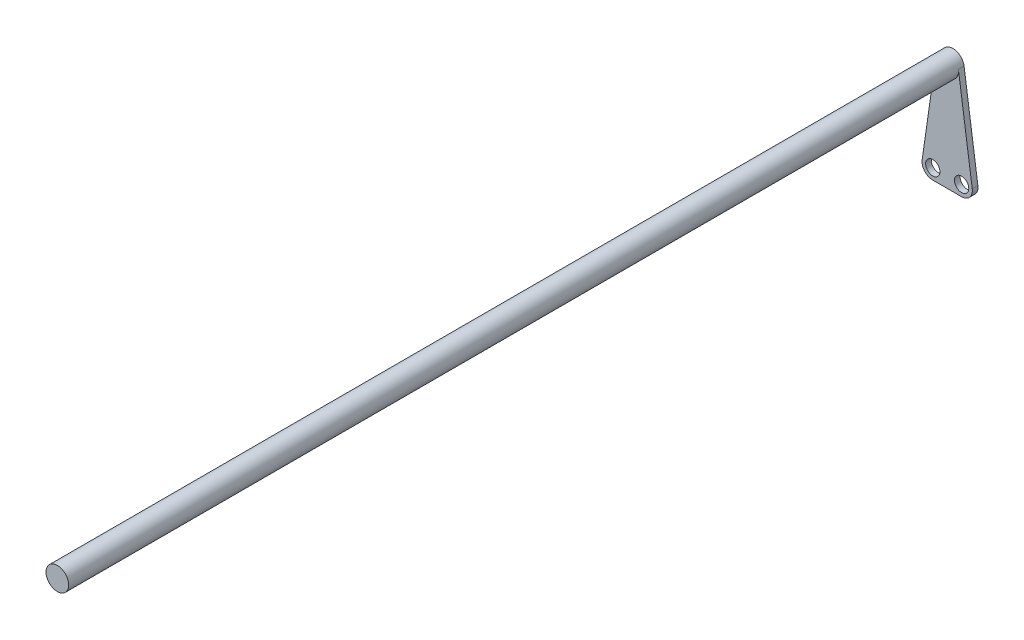
ISO-10303-21;
HEADER;
FILE_DESCRIPTION(('STEP AP214'),'2;1');
FILE_NAME('part.step','',(''),(''),'','','');
FILE_SCHEMA(('AUTOMOTIVE_DESIGN { 1 0 10303 214 1 1 1 1 }'));
ENDSEC;
DATA;
#1=APPLICATION_CONTEXT('core data for automotive mechanical design processes');
#2=APPLICATION_PROTOCOL_DEFINITION('international standard','automotive_design',2000,#1);
#3=PRODUCT_CONTEXT('',#1,'mechanical');
#4=PRODUCT('Part','Part','',(#3));
#5=PRODUCT_RELATED_PRODUCT_CATEGORY('part','',(#4));
#6=PRODUCT_DEFINITION_FORMATION('','',#4);
#7=PRODUCT_DEFINITION_CONTEXT('part definition',#1,'design');
#8=PRODUCT_DEFINITION('design','',#6,#7);
#9=PRODUCT_DEFINITION_SHAPE('','',#8);
#10=(LENGTH_UNIT() NAMED_UNIT(*) SI_UNIT(.MILLI.,.METRE.));
#11=(NAMED_UNIT(*) PLANE_ANGLE_UNIT() SI_UNIT($,.RADIAN.));
#12=(NAMED_UNIT(*) SI_UNIT($,.STERADIAN.) SOLID_ANGLE_UNIT());
#13=UNCERTAINTY_MEASURE_WITH_UNIT(LENGTH_MEASURE(1.E-05),#10,'distance_accuracy_value','');
#14=(GEOMETRIC_REPRESENTATION_CONTEXT(3) GLOBAL_UNCERTAINTY_ASSIGNED_CONTEXT((#13)) GLOBAL_UNIT_ASSIGNED_CONTEXT((#10,
#11,#12)) REPRESENTATION_CONTEXT('',''));
#15=CARTESIAN_POINT('',(0.,0.,0.));
#16=DIRECTION('',(0.,0.,1.));
#17=DIRECTION('',(1.,0.,0.));
#18=AXIS2_PLACEMENT_3D('',#15,#16,#17);
#19=CARTESIAN_POINT('',(0.,0.,250.));
#20=DIRECTION('',(0.,0.,-1.));
#21=DIRECTION('',(-1.,0.,0.));
#22=AXIS2_PLACEMENT_3D('',#19,#20,#21);
#23=CYLINDRICAL_SURFACE('',#22,6.35);
#24=DIRECTION('',(0.,0.,1.));
#25=VECTOR('',#24,1.);
#26=CARTESIAN_POINT('',(-6.28597532631454,0.899452164911968,-251.5875));
#27=LINE('',#26,#25);
#28=CARTESIAN_POINT('',(-6.28597532631454,0.899452164911968,-251.5875));
#29=VERTEX_POINT('',#28);
#30=CARTESIAN_POINT('',(-6.28597532631454,0.899452164911968,-248.4125));
#31=VERTEX_POINT('',#30);
#32=EDGE_CURVE('E90',#29,#31,#27,.T.);
#33=ORIENTED_EDGE('',*,*,#32,.T.);
#34=CARTESIAN_POINT('',(0.,0.,-248.4125));
#35=DIRECTION('',(0.,0.,-1.));
#36=DIRECTION('',(-1.,0.,0.));
#37=AXIS2_PLACEMENT_3D('',#34,#35,#36);
#38=CIRCLE('',#37,6.35);
#39=CARTESIAN_POINT('',(6.28597532631454,0.899452164911968,-248.4125));
#40=VERTEX_POINT('',#39);
#41=EDGE_CURVE('E11',#40,#31,#38,.T.);
#42=ORIENTED_EDGE('',*,*,#41,.F.);
#43=DIRECTION('',(0.,0.,1.));
#44=VECTOR('',#43,1.);
#45=CARTESIAN_POINT('',(6.28597532631454,0.899452164911968,-251.5875));
#46=LINE('',#45,#44);
#47=CARTESIAN_POINT('',(6.28597532631454,0.899452164911968,-251.5875));
#48=VERTEX_POINT('',#47);
#49=EDGE_CURVE('E157',#48,#40,#46,.T.);
#50=ORIENTED_EDGE('',*,*,#49,.F.);
#51=CARTESIAN_POINT('',(0.,0.,-251.5875));
#52=DIRECTION('',(0.,0.,-1.));
#53=DIRECTION('',(-1.,0.,0.));
#54=AXIS2_PLACEMENT_3D('',#51,#52,#53);
#55=CIRCLE('',#54,6.35);
#56=EDGE_CURVE('E146',#29,#48,#55,.T.);
#57=ORIENTED_EDGE('',*,*,#56,.F.);
#58=EDGE_LOOP('',(#33,#42,#50,#57));
#59=FACE_BOUND('',#58,.T.);
#60=CARTESIAN_POINT('',(0.,0.,250.));
#61=DIRECTION('',(0.,0.,1.));
#62=DIRECTION('',(1.,0.,0.));
#63=AXIS2_PLACEMENT_3D('',#60,#61,#62);
#64=CIRCLE('',#63,6.35);
#65=CARTESIAN_POINT('',(6.35,0.,250.));
#66=VERTEX_POINT('',#65);
#67=EDGE_CURVE('E52',#66,#66,#64,.T.);
#68=ORIENTED_EDGE('',*,*,#67,.F.);
#69=EDGE_LOOP('',(#68));
#70=FACE_BOUND('',#69,.T.);
#71=ADVANCED_FACE('F43',(#59,#70),#23,.T.);
#72=CARTESIAN_POINT('',(0.,0.,250.));
#73=DIRECTION('',(0.,0.,1.));
#74=DIRECTION('',(1.,0.,0.));
#75=AXIS2_PLACEMENT_3D('',#72,#73,#74);
#76=PLANE('',#75);
#77=ORIENTED_EDGE('',*,*,#67,.T.);
#78=EDGE_LOOP('',(#77));
#79=FACE_BOUND('',#78,.T.);
#80=ADVANCED_FACE('F163',(#79),#76,.T.);
#81=CARTESIAN_POINT('',(6.28597532631454,0.899452164911968,-251.5875));
#82=DIRECTION('',(-0.989917374222762,-0.141646010222357,0.));
#83=DIRECTION('',(0.141646010222357,-0.989917374222762,0.));
#84=AXIS2_PLACEMENT_3D('',#81,#82,#83);
#85=PLANE('',#84);
#86=DIRECTION('',(0.141646010222357,-0.989917374222762,0.));
#87=VECTOR('',#86,1.);
#88=CARTESIAN_POINT('',(6.28597532631454,0.899452164911968,-248.4125));
#89=LINE('',#88,#87);
#90=CARTESIAN_POINT('',(14.0198600005708,-53.1501239386658,-248.4125));
#91=VERTEX_POINT('',#90);
#92=EDGE_CURVE('E131',#40,#91,#89,.T.);
#93=ORIENTED_EDGE('',*,*,#92,.T.);
#94=DIRECTION('',(0.,0.,1.));
#95=VECTOR('',#94,1.);
#96=CARTESIAN_POINT('',(14.0198600005708,-53.1501239386658,-251.5875));
#97=LINE('',#96,#95);
#98=CARTESIAN_POINT('',(14.0198600005708,-53.1501239386658,-251.5875));
#99=VERTEX_POINT('',#98);
#100=EDGE_CURVE('E153',#99,#91,#97,.T.);
#101=ORIENTED_EDGE('',*,*,#100,.F.);
#102=DIRECTION('',(0.141646010222357,-0.989917374222762,0.));
#103=VECTOR('',#102,1.);
#104=CARTESIAN_POINT('',(6.28597532631454,0.899452164911968,-251.5875));
#105=LINE('',#104,#103);
#106=EDGE_CURVE('E97',#48,#99,#105,.T.);
#107=ORIENTED_EDGE('',*,*,#106,.F.);
#108=ORIENTED_EDGE('',*,*,#49,.T.);
#109=EDGE_LOOP('',(#93,#101,#107,#108));
#110=FACE_BOUND('',#109,.T.);
#111=ADVANCED_FACE('F169',(#110),#85,.F.);
#112=CARTESIAN_POINT('',(8.08035575523426,-54.,-251.5875));
#113=DIRECTION('',(0.,0.,1.));
#114=DIRECTION('',(1.,0.,0.));
#115=AXIS2_PLACEMENT_3D('',#112,#113,#114);
#116=CYLINDRICAL_SURFACE('',#115,6.);
#117=CARTESIAN_POINT('',(8.08035575523426,-54.,-248.4125));
#118=DIRECTION('',(0.,0.,-1.));
#119=DIRECTION('',(-1.,0.,0.));
#120=AXIS2_PLACEMENT_3D('',#117,#118,#119);
#121=CIRCLE('',#120,6.);
#122=CARTESIAN_POINT('',(8.08035575523422,-60.,-248.4125));
#123=VERTEX_POINT('',#122);
#124=EDGE_CURVE('E134',#91,#123,#121,.T.);
#125=ORIENTED_EDGE('',*,*,#124,.T.);
#126=DIRECTION('',(0.,0.,1.));
#127=VECTOR('',#126,1.);
#128=CARTESIAN_POINT('',(8.08035575523422,-60.,-251.5875));
#129=LINE('',#128,#127);
#130=CARTESIAN_POINT('',(8.08035575523422,-60.,-251.5875));
#131=VERTEX_POINT('',#130);
#132=EDGE_CURVE('E121',#131,#123,#129,.T.);
#133=ORIENTED_EDGE('',*,*,#132,.F.);
#134=CARTESIAN_POINT('',(8.08035575523426,-54.,-251.5875));
#135=DIRECTION('',(0.,0.,-1.));
#136=DIRECTION('',(-1.,0.,0.));
#137=AXIS2_PLACEMENT_3D('',#134,#135,#136);
#138=CIRCLE('',#137,6.);
#139=EDGE_CURVE('E110',#99,#131,#138,.T.);
#140=ORIENTED_EDGE('',*,*,#139,.F.);
#141=ORIENTED_EDGE('',*,*,#100,.T.);
#142=EDGE_LOOP('',(#125,#133,#140,#141));
#143=FACE_BOUND('',#142,.T.);
#144=ADVANCED_FACE('F173',(#143),#116,.T.);
#145=CARTESIAN_POINT('',(8.08035575523421,-60.,-251.5875));
#146=DIRECTION('',(0.,1.,0.));
#147=DIRECTION('',(0.,0.,1.));
#148=AXIS2_PLACEMENT_3D('',#145,#146,#147);
#149=PLANE('',#148);
#150=DIRECTION('',(-1.,0.,0.));
#151=VECTOR('',#150,1.);
#152=CARTESIAN_POINT('',(8.08035575523421,-60.,-248.4125));
#153=LINE('',#152,#151);
#154=CARTESIAN_POINT('',(-8.08035575523421,-60.,-248.4125));
#155=VERTEX_POINT('',#154);
#156=EDGE_CURVE('E119',#123,#155,#153,.T.);
#157=ORIENTED_EDGE('',*,*,#156,.T.);
#158=DIRECTION('',(0.,0.,1.));
#159=VECTOR('',#158,1.);
#160=CARTESIAN_POINT('',(-8.08035575523421,-60.,-251.5875));
#161=LINE('',#160,#159);
#162=CARTESIAN_POINT('',(-8.08035575523421,-60.,-251.5875));
#163=VERTEX_POINT('',#162);
#164=EDGE_CURVE('E116',#163,#155,#161,.T.);
#165=ORIENTED_EDGE('',*,*,#164,.F.);
#166=DIRECTION('',(-1.,0.,0.));
#167=VECTOR('',#166,1.);
#168=CARTESIAN_POINT('',(8.08035575523421,-60.,-251.5875));
#169=LINE('',#168,#167);
#170=EDGE_CURVE('E104',#131,#163,#169,.T.);
#171=ORIENTED_EDGE('',*,*,#170,.F.);
#172=ORIENTED_EDGE('',*,*,#132,.T.);
#173=EDGE_LOOP('',(#157,#165,#171,#172));
#174=FACE_BOUND('',#173,.T.);
#175=ADVANCED_FACE('F117',(#174),#149,.F.);
#176=CARTESIAN_POINT('',(-8.08035575523426,-54.,-251.5875));
#177=DIRECTION('',(0.,0.,1.));
#178=DIRECTION('',(1.,0.,0.));
#179=AXIS2_PLACEMENT_3D('',#176,#177,#178);
#180=CYLINDRICAL_SURFACE('',#179,6.);
#181=CARTESIAN_POINT('',(-8.08035575523426,-54.,-248.4125));
#182=DIRECTION('',(0.,0.,-1.));
#183=DIRECTION('',(-1.,0.,0.));
#184=AXIS2_PLACEMENT_3D('',#181,#182,#183);
#185=CIRCLE('',#184,6.);
#186=CARTESIAN_POINT('',(-14.0198600005708,-53.1501239386658,-248.4125));
#187=VERTEX_POINT('',#186);
#188=EDGE_CURVE('E83',#155,#187,#185,.T.);
#189=ORIENTED_EDGE('',*,*,#188,.T.);
#190=DIRECTION('',(0.,0.,1.));
#191=VECTOR('',#190,1.);
#192=CARTESIAN_POINT('',(-14.0198600005708,-53.1501239386658,-251.5875));
#193=LINE('',#192,#191);
#194=CARTESIAN_POINT('',(-14.0198600005708,-53.1501239386658,-251.5875));
#195=VERTEX_POINT('',#194);
#196=EDGE_CURVE('E122',#195,#187,#193,.T.);
#197=ORIENTED_EDGE('',*,*,#196,.F.);
#198=CARTESIAN_POINT('',(-8.08035575523426,-54.,-251.5875));
#199=DIRECTION('',(0.,0.,-1.));
#200=DIRECTION('',(-1.,0.,0.));
#201=AXIS2_PLACEMENT_3D('',#198,#199,#200);
#202=CIRCLE('',#201,6.);
#203=EDGE_CURVE('E108',#163,#195,#202,.T.);
#204=ORIENTED_EDGE('',*,*,#203,.F.);
#205=ORIENTED_EDGE('',*,*,#164,.T.);
#206=EDGE_LOOP('',(#189,#197,#204,#205));
#207=FACE_BOUND('',#206,.T.);
#208=ADVANCED_FACE('F124',(#207),#180,.T.);
#209=CARTESIAN_POINT('',(-14.0198600005708,-53.1501239386658,-251.5875));
#210=DIRECTION('',(0.989917374222762,-0.141646010222357,0.));
#211=DIRECTION('',(0.141646010222357,0.989917374222762,0.));
#212=AXIS2_PLACEMENT_3D('',#209,#210,#211);
#213=PLANE('',#212);
#214=DIRECTION('',(0.141646010222357,0.989917374222762,0.));
#215=VECTOR('',#214,1.);
#216=CARTESIAN_POINT('',(-14.0198600005708,-53.1501239386658,-248.4125));
#217=LINE('',#216,#215);
#218=EDGE_CURVE('E142',#187,#31,#217,.T.);
#219=ORIENTED_EDGE('',*,*,#218,.T.);
#220=ORIENTED_EDGE('',*,*,#32,.F.);
#221=DIRECTION('',(0.141646010222357,0.989917374222762,0.));
#222=VECTOR('',#221,1.);
#223=CARTESIAN_POINT('',(-14.0198600005708,-53.1501239386658,-251.5875));
#224=LINE('',#223,#222);
#225=EDGE_CURVE('E60',#195,#29,#224,.T.);
#226=ORIENTED_EDGE('',*,*,#225,.F.);
#227=ORIENTED_EDGE('',*,*,#196,.T.);
#228=EDGE_LOOP('',(#219,#220,#226,#227));
#229=FACE_BOUND('',#228,.T.);
#230=ADVANCED_FACE('F183',(#229),#213,.F.);
#231=CARTESIAN_POINT('',(0.,0.,-251.5875));
#232=DIRECTION('',(0.,0.,-1.));
#233=DIRECTION('',(-1.,0.,0.));
#234=AXIS2_PLACEMENT_3D('',#231,#232,#233);
#235=PLANE('',#234);
#236=CARTESIAN_POINT('',(-8.08035575523426,-54.,-251.5875));
#237=DIRECTION('',(0.,0.,-1.));
#238=DIRECTION('',(-1.,0.,0.));
#239=AXIS2_PLACEMENT_3D('',#236,#237,#238);
#240=CIRCLE('',#239,4.);
#241=CARTESIAN_POINT('',(-12.0803557552343,-54.,-251.5875));
#242=VERTEX_POINT('',#241);
#243=EDGE_CURVE('E206',#242,#242,#240,.F.);
#244=ORIENTED_EDGE('',*,*,#243,.T.);
#245=EDGE_LOOP('',(#244));
#246=FACE_BOUND('',#245,.T.);
#247=CARTESIAN_POINT('',(8.08035575523426,-54.,-251.5875));
#248=DIRECTION('',(0.,0.,-1.));
#249=DIRECTION('',(-1.,0.,0.));
#250=AXIS2_PLACEMENT_3D('',#247,#248,#249);
#251=CIRCLE('',#250,4.);
#252=CARTESIAN_POINT('',(4.08035575523426,-54.,-251.5875));
#253=VERTEX_POINT('',#252);
#254=EDGE_CURVE('E212',#253,#253,#251,.F.);
#255=ORIENTED_EDGE('',*,*,#254,.T.);
#256=EDGE_LOOP('',(#255));
#257=FACE_BOUND('',#256,.T.);
#258=ORIENTED_EDGE('',*,*,#56,.T.);
#259=ORIENTED_EDGE('',*,*,#106,.T.);
#260=ORIENTED_EDGE('',*,*,#139,.T.);
#261=ORIENTED_EDGE('',*,*,#170,.T.);
#262=ORIENTED_EDGE('',*,*,#203,.T.);
#263=ORIENTED_EDGE('',*,*,#225,.T.);
#264=EDGE_LOOP('',(#258,#259,#260,#261,#262,#263));
#265=FACE_BOUND('',#264,.T.);
#266=ADVANCED_FACE('F106',(#246,#257,#265),#235,.T.);
#267=CARTESIAN_POINT('',(0.,0.,-248.4125));
#268=DIRECTION('',(0.,0.,-1.));
#269=DIRECTION('',(-1.,0.,0.));
#270=AXIS2_PLACEMENT_3D('',#267,#268,#269);
#271=PLANE('',#270);
#272=CARTESIAN_POINT('',(-8.08035575523426,-54.,-248.4125));
#273=DIRECTION('',(0.,0.,1.));
#274=DIRECTION('',(1.,0.,0.));
#275=AXIS2_PLACEMENT_3D('',#272,#273,#274);
#276=CIRCLE('',#275,4.);
#277=CARTESIAN_POINT('',(-4.08035575523426,-54.,-248.4125));
#278=VERTEX_POINT('',#277);
#279=EDGE_CURVE('E135',#278,#278,#276,.T.);
#280=ORIENTED_EDGE('',*,*,#279,.F.);
#281=EDGE_LOOP('',(#280));
#282=FACE_BOUND('',#281,.T.);
#283=CARTESIAN_POINT('',(8.08035575523426,-54.,-248.4125));
#284=DIRECTION('',(0.,0.,1.));
#285=DIRECTION('',(1.,0.,0.));
#286=AXIS2_PLACEMENT_3D('',#283,#284,#285);
#287=CIRCLE('',#286,4.);
#288=CARTESIAN_POINT('',(12.0803557552343,-54.,-248.4125));
#289=VERTEX_POINT('',#288);
#290=EDGE_CURVE('E218',#289,#289,#287,.T.);
#291=ORIENTED_EDGE('',*,*,#290,.F.);
#292=EDGE_LOOP('',(#291));
#293=FACE_BOUND('',#292,.T.);
#294=ORIENTED_EDGE('',*,*,#92,.F.);
#295=ORIENTED_EDGE('',*,*,#41,.T.);
#296=ORIENTED_EDGE('',*,*,#218,.F.);
#297=ORIENTED_EDGE('',*,*,#188,.F.);
#298=ORIENTED_EDGE('',*,*,#156,.F.);
#299=ORIENTED_EDGE('',*,*,#124,.F.);
#300=EDGE_LOOP('',(#294,#295,#296,#297,#298,#299));
#301=FACE_BOUND('',#300,.T.);
#302=ADVANCED_FACE('F187',(#282,#293,#301),#271,.F.);
#303=CARTESIAN_POINT('',(8.08035575523426,-54.,-251.5885));
#304=DIRECTION('',(0.,0.,1.));
#305=DIRECTION('',(1.,0.,0.));
#306=AXIS2_PLACEMENT_3D('',#303,#304,#305);
#307=CYLINDRICAL_SURFACE('',#306,4.);
#308=ORIENTED_EDGE('',*,*,#254,.F.);
#309=EDGE_LOOP('',(#308));
#310=FACE_BOUND('',#309,.T.);
#311=ORIENTED_EDGE('',*,*,#290,.T.);
#312=EDGE_LOOP('',(#311));
#313=FACE_BOUND('',#312,.T.);
#314=ADVANCED_FACE('F190',(#310,#313),#307,.F.);
#315=CARTESIAN_POINT('',(-8.08035575523426,-54.,-251.5885));
#316=DIRECTION('',(0.,0.,1.));
#317=DIRECTION('',(1.,0.,0.));
#318=AXIS2_PLACEMENT_3D('',#315,#316,#317);
#319=CYLINDRICAL_SURFACE('',#318,4.);
#320=ORIENTED_EDGE('',*,*,#243,.F.);
#321=EDGE_LOOP('',(#320));
#322=FACE_BOUND('',#321,.T.);
#323=ORIENTED_EDGE('',*,*,#279,.T.);
#324=EDGE_LOOP('',(#323));
#325=FACE_BOUND('',#324,.T.);
#326=ADVANCED_FACE('F197',(#322,#325),#319,.F.);
#327=CLOSED_SHELL('',(#71,#80,#111,#144,#175,#208,#230,#266,#302,#314,#326));
#328=MANIFOLD_SOLID_BREP('B2',#327);
#329=ADVANCED_BREP_SHAPE_REPRESENTATION('',(#18,#328),#14);
#330=SHAPE_DEFINITION_REPRESENTATION(#9,#329);
ENDSEC;
END-ISO-10303-21;
